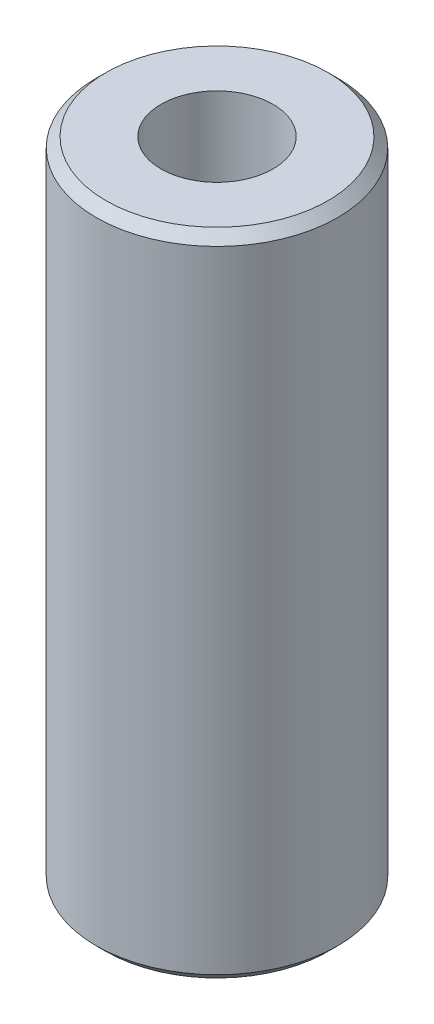
ISO-10303-21;
HEADER;
FILE_DESCRIPTION(('STEP AP214'),'2;1');
FILE_NAME('part.step','',(''),(''),'','','');
FILE_SCHEMA(('AUTOMOTIVE_DESIGN { 1 0 10303 214 1 1 1 1 }'));
ENDSEC;
DATA;
#1=APPLICATION_CONTEXT('core data for automotive mechanical design processes');
#2=APPLICATION_PROTOCOL_DEFINITION('international standard','automotive_design',2000,#1);
#3=PRODUCT_CONTEXT('',#1,'mechanical');
#4=PRODUCT('Part','Part','',(#3));
#5=PRODUCT_RELATED_PRODUCT_CATEGORY('part','',(#4));
#6=PRODUCT_DEFINITION_FORMATION('','',#4);
#7=PRODUCT_DEFINITION_CONTEXT('part definition',#1,'design');
#8=PRODUCT_DEFINITION('design','',#6,#7);
#9=PRODUCT_DEFINITION_SHAPE('','',#8);
#10=(LENGTH_UNIT() NAMED_UNIT(*) SI_UNIT(.MILLI.,.METRE.));
#11=(NAMED_UNIT(*) PLANE_ANGLE_UNIT() SI_UNIT($,.RADIAN.));
#12=(NAMED_UNIT(*) SI_UNIT($,.STERADIAN.) SOLID_ANGLE_UNIT());
#13=UNCERTAINTY_MEASURE_WITH_UNIT(LENGTH_MEASURE(1.E-05),#10,'distance_accuracy_value','');
#14=(GEOMETRIC_REPRESENTATION_CONTEXT(3) GLOBAL_UNCERTAINTY_ASSIGNED_CONTEXT((#13)) GLOBAL_UNIT_ASSIGNED_CONTEXT((#10,
#11,#12)) REPRESENTATION_CONTEXT('',''));
#15=CARTESIAN_POINT('',(0.,0.,0.));
#16=DIRECTION('',(0.,0.,1.));
#17=DIRECTION('',(1.,0.,0.));
#18=AXIS2_PLACEMENT_3D('',#15,#16,#17);
#19=CARTESIAN_POINT('',(0.,309.584803722769,0.));
#20=DIRECTION('',(0.,-1.,0.));
#21=DIRECTION('',(0.,0.,-1.));
#22=AXIS2_PLACEMENT_3D('',#19,#20,#21);
#23=CYLINDRICAL_SURFACE('',#22,57.5);
#24=CARTESIAN_POINT('',(0.,304.946213124851,0.));
#25=DIRECTION('',(0.,1.,0.));
#26=DIRECTION('',(0.,0.,1.));
#27=AXIS2_PLACEMENT_3D('',#24,#25,#26);
#28=CIRCLE('',#27,57.5);
#29=CARTESIAN_POINT('',(0.,304.946213124851,57.5));
#30=VERTEX_POINT('',#29);
#31=EDGE_CURVE('E50',#30,#30,#28,.F.);
#32=ORIENTED_EDGE('',*,*,#31,.T.);
#33=EDGE_LOOP('',(#32));
#34=FACE_BOUND('',#33,.T.);
#35=CARTESIAN_POINT('',(0.,4.63859059791866,0.));
#36=DIRECTION('',(0.,1.,0.));
#37=DIRECTION('',(0.,0.,1.));
#38=AXIS2_PLACEMENT_3D('',#35,#36,#37);
#39=CIRCLE('',#38,57.5);
#40=CARTESIAN_POINT('',(0.,4.63859059791866,57.5));
#41=VERTEX_POINT('',#40);
#42=EDGE_CURVE('E51',#41,#41,#39,.T.);
#43=ORIENTED_EDGE('',*,*,#42,.T.);
#44=EDGE_LOOP('',(#43));
#45=FACE_BOUND('',#44,.T.);
#46=ADVANCED_FACE('F39',(#34,#45),#23,.T.);
#47=CARTESIAN_POINT('',(0.,309.584803722769,0.));
#48=DIRECTION('',(0.,1.,0.));
#49=DIRECTION('',(0.,0.,1.));
#50=AXIS2_PLACEMENT_3D('',#47,#48,#49);
#51=PLANE('',#50);
#52=CARTESIAN_POINT('',(0.,309.584803722769,0.));
#53=DIRECTION('',(0.,1.,0.));
#54=DIRECTION('',(0.,0.,1.));
#55=AXIS2_PLACEMENT_3D('',#52,#53,#54);
#56=CIRCLE('',#55,52.8614094020814);
#57=CARTESIAN_POINT('',(0.,309.584803722769,52.8614094020814));
#58=VERTEX_POINT('',#57);
#59=EDGE_CURVE('E54',#58,#58,#56,.T.);
#60=ORIENTED_EDGE('',*,*,#59,.T.);
#61=EDGE_LOOP('',(#60));
#62=FACE_BOUND('',#61,.T.);
#63=CARTESIAN_POINT('',(0.,309.584803722769,0.));
#64=DIRECTION('',(0.,1.,0.));
#65=DIRECTION('',(0.,0.,1.));
#66=AXIS2_PLACEMENT_3D('',#63,#64,#65);
#67=CIRCLE('',#66,26.6849786378342);
#68=CARTESIAN_POINT('',(0.,309.584803722769,26.6849786378342));
#69=VERTEX_POINT('',#68);
#70=EDGE_CURVE('E58',#69,#69,#67,.T.);
#71=ORIENTED_EDGE('',*,*,#70,.F.);
#72=EDGE_LOOP('',(#71));
#73=FACE_BOUND('',#72,.T.);
#74=ADVANCED_FACE('F69',(#62,#73),#51,.T.);
#75=CARTESIAN_POINT('',(0.,0.,0.));
#76=DIRECTION('',(0.,1.,0.));
#77=DIRECTION('',(0.,0.,1.));
#78=AXIS2_PLACEMENT_3D('',#75,#76,#77);
#79=PLANE('',#78);
#80=CARTESIAN_POINT('',(0.,0.,0.));
#81=DIRECTION('',(0.,1.,0.));
#82=DIRECTION('',(0.,0.,1.));
#83=AXIS2_PLACEMENT_3D('',#80,#81,#82);
#84=CIRCLE('',#83,52.8614094020813);
#85=CARTESIAN_POINT('',(0.,0.,52.8614094020813));
#86=VERTEX_POINT('',#85);
#87=EDGE_CURVE('E10',#86,#86,#84,.F.);
#88=ORIENTED_EDGE('',*,*,#87,.T.);
#89=EDGE_LOOP('',(#88));
#90=FACE_BOUND('',#89,.T.);
#91=CARTESIAN_POINT('',(0.,0.,0.));
#92=DIRECTION('',(0.,1.,0.));
#93=DIRECTION('',(0.,0.,1.));
#94=AXIS2_PLACEMENT_3D('',#91,#92,#93);
#95=CIRCLE('',#94,26.6849786378342);
#96=CARTESIAN_POINT('',(0.,0.,26.6849786378342));
#97=VERTEX_POINT('',#96);
#98=EDGE_CURVE('E63',#97,#97,#95,.T.);
#99=ORIENTED_EDGE('',*,*,#98,.T.);
#100=EDGE_LOOP('',(#99));
#101=FACE_BOUND('',#100,.T.);
#102=ADVANCED_FACE('F75',(#90,#101),#79,.F.);
#103=CARTESIAN_POINT('',(0.,309.584803722769,0.));
#104=DIRECTION('',(0.,-1.,0.));
#105=DIRECTION('',(0.,0.,-1.));
#106=AXIS2_PLACEMENT_3D('',#103,#104,#105);
#107=CYLINDRICAL_SURFACE('',#106,26.6849786378342);
#108=ORIENTED_EDGE('',*,*,#70,.T.);
#109=EDGE_LOOP('',(#108));
#110=FACE_BOUND('',#109,.T.);
#111=ORIENTED_EDGE('',*,*,#98,.F.);
#112=EDGE_LOOP('',(#111));
#113=FACE_BOUND('',#112,.T.);
#114=ADVANCED_FACE('F70',(#110,#113),#107,.F.);
#115=CARTESIAN_POINT('',(0.,309.584803722769,0.));
#116=DIRECTION('',(0.,-1.,0.));
#117=DIRECTION('',(0.,0.,-1.));
#118=AXIS2_PLACEMENT_3D('',#115,#116,#117);
#119=CONICAL_SURFACE('',#118,52.8614094020814,0.785398163397443);
#120=ORIENTED_EDGE('',*,*,#31,.F.);
#121=EDGE_LOOP('',(#120));
#122=FACE_BOUND('',#121,.T.);
#123=ORIENTED_EDGE('',*,*,#59,.F.);
#124=EDGE_LOOP('',(#123));
#125=FACE_BOUND('',#124,.T.);
#126=ADVANCED_FACE('F81',(#122,#125),#119,.T.);
#127=CARTESIAN_POINT('',(0.,4.63859059791866,0.));
#128=DIRECTION('',(0.,1.,0.));
#129=DIRECTION('',(0.,0.,1.));
#130=AXIS2_PLACEMENT_3D('',#127,#128,#129);
#131=CONICAL_SURFACE('',#130,57.5,0.785398163397448);
#132=ORIENTED_EDGE('',*,*,#87,.F.);
#133=EDGE_LOOP('',(#132));
#134=FACE_BOUND('',#133,.T.);
#135=ORIENTED_EDGE('',*,*,#42,.F.);
#136=EDGE_LOOP('',(#135));
#137=FACE_BOUND('',#136,.T.);
#138=ADVANCED_FACE('F45',(#134,#137),#131,.T.);
#139=CLOSED_SHELL('',(#46,#74,#102,#114,#126,#138));
#140=MANIFOLD_SOLID_BREP('B2',#139);
#141=ADVANCED_BREP_SHAPE_REPRESENTATION('',(#18,#140),#14);
#142=SHAPE_DEFINITION_REPRESENTATION(#9,#141);
ENDSEC;
END-ISO-10303-21;
